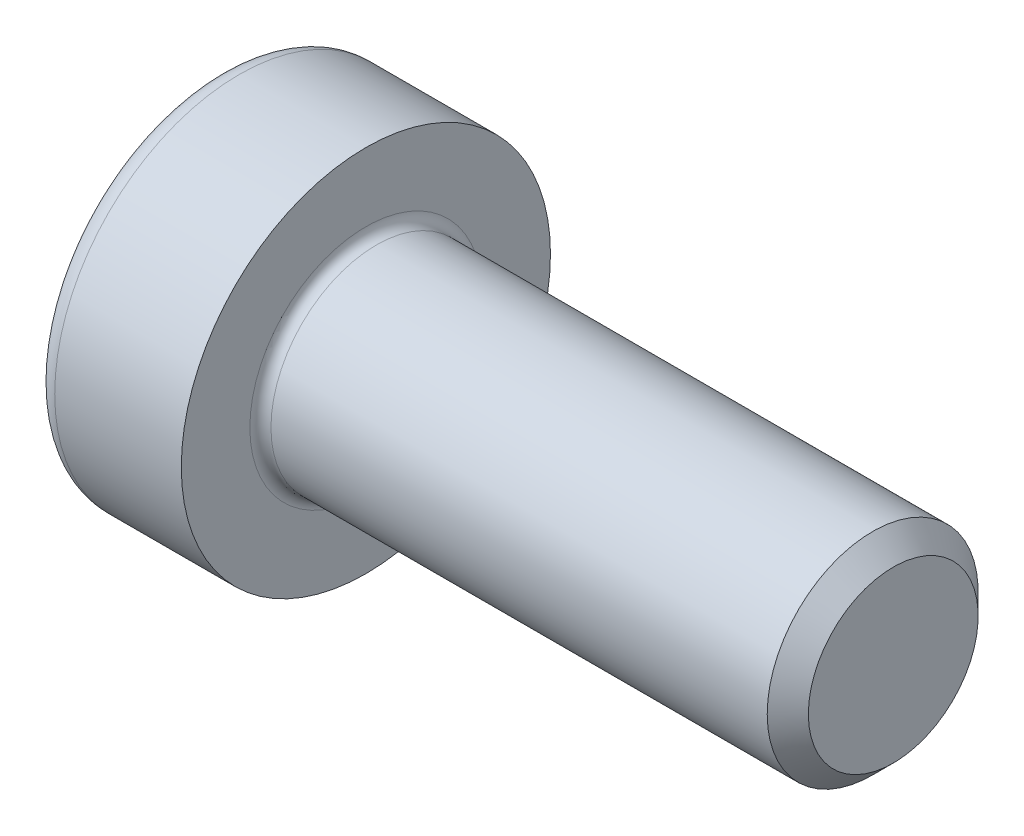
ISO-10303-21;
HEADER;
FILE_DESCRIPTION(('STEP AP214'),'2;1');
FILE_NAME('part.step','',(''),(''),'','','');
FILE_SCHEMA(('AUTOMOTIVE_DESIGN { 1 0 10303 214 1 1 1 1 }'));
ENDSEC;
DATA;
#1=APPLICATION_CONTEXT('core data for automotive mechanical design processes');
#2=APPLICATION_PROTOCOL_DEFINITION('international standard','automotive_design',2000,#1);
#3=PRODUCT_CONTEXT('',#1,'mechanical');
#4=PRODUCT('Part','Part','',(#3));
#5=PRODUCT_RELATED_PRODUCT_CATEGORY('part','',(#4));
#6=PRODUCT_DEFINITION_FORMATION('','',#4);
#7=PRODUCT_DEFINITION_CONTEXT('part definition',#1,'design');
#8=PRODUCT_DEFINITION('design','',#6,#7);
#9=PRODUCT_DEFINITION_SHAPE('','',#8);
#10=(LENGTH_UNIT() NAMED_UNIT(*) SI_UNIT(.MILLI.,.METRE.));
#11=(NAMED_UNIT(*) PLANE_ANGLE_UNIT() SI_UNIT($,.RADIAN.));
#12=(NAMED_UNIT(*) SI_UNIT($,.STERADIAN.) SOLID_ANGLE_UNIT());
#13=UNCERTAINTY_MEASURE_WITH_UNIT(LENGTH_MEASURE(1.E-05),#10,'distance_accuracy_value','');
#14=(GEOMETRIC_REPRESENTATION_CONTEXT(3) GLOBAL_UNCERTAINTY_ASSIGNED_CONTEXT((#13)) GLOBAL_UNIT_ASSIGNED_CONTEXT((#10,
#11,#12)) REPRESENTATION_CONTEXT('',''));
#15=CARTESIAN_POINT('',(0.,0.,0.));
#16=DIRECTION('',(0.,0.,1.));
#17=DIRECTION('',(1.,0.,0.));
#18=AXIS2_PLACEMENT_3D('',#15,#16,#17);
#19=CARTESIAN_POINT('',(1.6,0.866025403784449,1.49999999999999));
#20=DIRECTION('',(-1.,0.,0.));
#21=DIRECTION('',(0.,0.,1.));
#22=AXIS2_PLACEMENT_3D('',#19,#20,#21);
#23=PLANE('',#22);
#24=CARTESIAN_POINT('',(1.6,0.,0.));
#25=DIRECTION('',(-1.,0.,0.));
#26=DIRECTION('',(0.,0.,1.));
#27=AXIS2_PLACEMENT_3D('',#24,#25,#26);
#28=CIRCLE('',#27,1.5);
#29=CARTESIAN_POINT('',(1.6,0.,1.5));
#30=VERTEX_POINT('',#29);
#31=CARTESIAN_POINT('',(1.6,1.29903810567666,0.749999999999996));
#32=VERTEX_POINT('',#31);
#33=EDGE_CURVE('E121',#30,#32,#28,.T.);
#34=ORIENTED_EDGE('',*,*,#33,.F.);
#35=DIRECTION('',(0.,1.,0.));
#36=VECTOR('',#35,1.);
#37=CARTESIAN_POINT('',(1.6,-0.866025403784428,1.5));
#38=LINE('',#37,#36);
#39=CARTESIAN_POINT('',(1.6,0.866025403784449,1.49999999999999));
#40=VERTEX_POINT('',#39);
#41=EDGE_CURVE('E128',#30,#40,#38,.T.);
#42=ORIENTED_EDGE('',*,*,#41,.T.);
#43=DIRECTION('',(0.,-0.499999999999998,0.86602540378444));
#44=VECTOR('',#43,1.);
#45=CARTESIAN_POINT('',(1.6,1.73205080756888,0.));
#46=LINE('',#45,#44);
#47=EDGE_CURVE('E129',#32,#40,#46,.T.);
#48=ORIENTED_EDGE('',*,*,#47,.F.);
#49=EDGE_LOOP('',(#34,#42,#48));
#50=FACE_BOUND('',#49,.T.);
#51=ADVANCED_FACE('F37',(#50),#23,.T.);
#52=CARTESIAN_POINT('',(1.6,0.,0.));
#53=DIRECTION('',(-1.,0.,0.));
#54=DIRECTION('',(0.,0.,1.));
#55=AXIS2_PLACEMENT_3D('',#52,#53,#54);
#56=CIRCLE('',#55,1.5);
#57=CARTESIAN_POINT('',(1.6,1.29903810567666,-0.750000000000002));
#58=VERTEX_POINT('',#57);
#59=EDGE_CURVE('E11',#32,#58,#56,.T.);
#60=ORIENTED_EDGE('',*,*,#59,.F.);
#61=CARTESIAN_POINT('',(1.6,1.73205080756888,0.));
#62=VERTEX_POINT('',#61);
#63=EDGE_CURVE('E125',#62,#32,#46,.T.);
#64=ORIENTED_EDGE('',*,*,#63,.F.);
#65=DIRECTION('',(0.,-0.500000000000001,-0.866025403784438));
#66=VECTOR('',#65,1.);
#67=CARTESIAN_POINT('',(1.6,1.73205080756888,0.));
#68=LINE('',#67,#66);
#69=EDGE_CURVE('E146',#62,#58,#68,.T.);
#70=ORIENTED_EDGE('',*,*,#69,.T.);
#71=EDGE_LOOP('',(#60,#64,#70));
#72=FACE_BOUND('',#71,.T.);
#73=ADVANCED_FACE('F250',(#72),#23,.T.);
#74=CARTESIAN_POINT('',(1.6,0.,-1.5));
#75=VERTEX_POINT('',#74);
#76=EDGE_CURVE('E46',#58,#75,#56,.T.);
#77=ORIENTED_EDGE('',*,*,#76,.F.);
#78=CARTESIAN_POINT('',(1.6,0.866025403784443,-1.50000000000001));
#79=VERTEX_POINT('',#78);
#80=EDGE_CURVE('E145',#58,#79,#68,.T.);
#81=ORIENTED_EDGE('',*,*,#80,.T.);
#82=DIRECTION('',(0.,-1.,0.));
#83=VECTOR('',#82,1.);
#84=CARTESIAN_POINT('',(1.6,0.866025403784443,-1.50000000000001));
#85=LINE('',#84,#83);
#86=EDGE_CURVE('E142',#79,#75,#85,.T.);
#87=ORIENTED_EDGE('',*,*,#86,.T.);
#88=EDGE_LOOP('',(#77,#81,#87));
#89=FACE_BOUND('',#88,.T.);
#90=ADVANCED_FACE('F215',(#89),#23,.T.);
#91=CARTESIAN_POINT('',(1.6,-1.29903810567666,-0.749999999999997));
#92=VERTEX_POINT('',#91);
#93=EDGE_CURVE('E199',#75,#92,#56,.T.);
#94=ORIENTED_EDGE('',*,*,#93,.F.);
#95=CARTESIAN_POINT('',(1.6,-0.866025403784433,-1.50000000000001));
#96=VERTEX_POINT('',#95);
#97=EDGE_CURVE('E141',#75,#96,#85,.T.);
#98=ORIENTED_EDGE('',*,*,#97,.T.);
#99=DIRECTION('',(0.,0.499999999999998,-0.86602540378444));
#100=VECTOR('',#99,1.);
#101=CARTESIAN_POINT('',(1.6,-1.73205080756887,0.));
#102=LINE('',#101,#100);
#103=EDGE_CURVE('E137',#92,#96,#102,.T.);
#104=ORIENTED_EDGE('',*,*,#103,.F.);
#105=EDGE_LOOP('',(#94,#98,#104));
#106=FACE_BOUND('',#105,.T.);
#107=ADVANCED_FACE('F210',(#106),#23,.T.);
#108=CARTESIAN_POINT('',(1.6,-1.29903810567665,0.749999999999996));
#109=VERTEX_POINT('',#108);
#110=EDGE_CURVE('E53',#92,#109,#56,.T.);
#111=ORIENTED_EDGE('',*,*,#110,.F.);
#112=CARTESIAN_POINT('',(1.6,-1.73205080756887,0.));
#113=VERTEX_POINT('',#112);
#114=EDGE_CURVE('E138',#113,#92,#102,.T.);
#115=ORIENTED_EDGE('',*,*,#114,.F.);
#116=DIRECTION('',(0.,-0.500000000000001,-0.866025403784438));
#117=VECTOR('',#116,1.);
#118=CARTESIAN_POINT('',(1.6,-0.866025403784428,1.5));
#119=LINE('',#118,#117);
#120=EDGE_CURVE('E133',#109,#113,#119,.T.);
#121=ORIENTED_EDGE('',*,*,#120,.F.);
#122=EDGE_LOOP('',(#111,#115,#121));
#123=FACE_BOUND('',#122,.T.);
#124=ADVANCED_FACE('F233',(#123),#23,.T.);
#125=CARTESIAN_POINT('',(0.,0.,0.));
#126=DIRECTION('',(-1.,0.,0.));
#127=DIRECTION('',(0.,0.,1.));
#128=AXIS2_PLACEMENT_3D('',#125,#126,#127);
#129=PLANE('',#128);
#130=CARTESIAN_POINT('',(0.,0.,0.));
#131=DIRECTION('',(-1.,0.,0.));
#132=DIRECTION('',(0.,0.,1.));
#133=AXIS2_PLACEMENT_3D('',#130,#131,#132);
#134=CIRCLE('',#133,3.1);
#135=CARTESIAN_POINT('',(0.,0.,3.1));
#136=VERTEX_POINT('',#135);
#137=EDGE_CURVE('E192',#136,#136,#134,.T.);
#138=ORIENTED_EDGE('',*,*,#137,.T.);
#139=EDGE_LOOP('',(#138));
#140=FACE_BOUND('',#139,.T.);
#141=DIRECTION('',(0.,-0.500000000000001,-0.866025403784438));
#142=VECTOR('',#141,1.);
#143=CARTESIAN_POINT('',(0.,1.73205080756888,0.));
#144=LINE('',#143,#142);
#145=CARTESIAN_POINT('',(0.,1.73205080756888,0.));
#146=VERTEX_POINT('',#145);
#147=CARTESIAN_POINT('',(0.,0.866025403784443,-1.50000000000001));
#148=VERTEX_POINT('',#147);
#149=EDGE_CURVE('E161',#146,#148,#144,.T.);
#150=ORIENTED_EDGE('',*,*,#149,.F.);
#151=DIRECTION('',(0.,-0.499999999999998,0.86602540378444));
#152=VECTOR('',#151,1.);
#153=CARTESIAN_POINT('',(0.,1.73205080756888,0.));
#154=LINE('',#153,#152);
#155=CARTESIAN_POINT('',(0.,0.866025403784449,1.49999999999999));
#156=VERTEX_POINT('',#155);
#157=EDGE_CURVE('E61',#146,#156,#154,.T.);
#158=ORIENTED_EDGE('',*,*,#157,.T.);
#159=DIRECTION('',(0.,1.,0.));
#160=VECTOR('',#159,1.);
#161=CARTESIAN_POINT('',(0.,-0.866025403784428,1.5));
#162=LINE('',#161,#160);
#163=CARTESIAN_POINT('',(0.,-0.866025403784428,1.5));
#164=VERTEX_POINT('',#163);
#165=EDGE_CURVE('E151',#164,#156,#162,.T.);
#166=ORIENTED_EDGE('',*,*,#165,.F.);
#167=DIRECTION('',(0.,-0.500000000000001,-0.866025403784438));
#168=VECTOR('',#167,1.);
#169=CARTESIAN_POINT('',(0.,-0.866025403784428,1.5));
#170=LINE('',#169,#168);
#171=CARTESIAN_POINT('',(0.,-1.73205080756887,0.));
#172=VERTEX_POINT('',#171);
#173=EDGE_CURVE('E154',#164,#172,#170,.T.);
#174=ORIENTED_EDGE('',*,*,#173,.T.);
#175=DIRECTION('',(0.,0.499999999999998,-0.86602540378444));
#176=VECTOR('',#175,1.);
#177=CARTESIAN_POINT('',(0.,-1.73205080756887,0.));
#178=LINE('',#177,#176);
#179=CARTESIAN_POINT('',(0.,-0.866025403784433,-1.50000000000001));
#180=VERTEX_POINT('',#179);
#181=EDGE_CURVE('E156',#172,#180,#178,.T.);
#182=ORIENTED_EDGE('',*,*,#181,.T.);
#183=DIRECTION('',(0.,-1.,0.));
#184=VECTOR('',#183,1.);
#185=CARTESIAN_POINT('',(0.,0.866025403784443,-1.50000000000001));
#186=LINE('',#185,#184);
#187=EDGE_CURVE('E158',#148,#180,#186,.T.);
#188=ORIENTED_EDGE('',*,*,#187,.F.);
#189=EDGE_LOOP('',(#150,#158,#166,#174,#182,#188));
#190=FACE_BOUND('',#189,.T.);
#191=ADVANCED_FACE('F223',(#140,#190),#129,.T.);
#192=CARTESIAN_POINT('',(-31.75,0.,0.));
#193=DIRECTION('',(-1.,0.,0.));
#194=DIRECTION('',(0.,0.,1.));
#195=AXIS2_PLACEMENT_3D('',#192,#193,#194);
#196=CYLINDRICAL_SURFACE('',#195,3.5);
#197=CARTESIAN_POINT('',(0.399999999999998,0.,0.));
#198=DIRECTION('',(-1.,0.,0.));
#199=DIRECTION('',(0.,0.,1.));
#200=AXIS2_PLACEMENT_3D('',#197,#198,#199);
#201=CIRCLE('',#200,3.5);
#202=CARTESIAN_POINT('',(0.399999999999998,0.,3.5));
#203=VERTEX_POINT('',#202);
#204=EDGE_CURVE('E194',#203,#203,#201,.F.);
#205=ORIENTED_EDGE('',*,*,#204,.T.);
#206=EDGE_LOOP('',(#205));
#207=FACE_BOUND('',#206,.T.);
#208=CARTESIAN_POINT('',(2.8,0.,0.));
#209=DIRECTION('',(-1.,0.,0.));
#210=DIRECTION('',(0.,0.,1.));
#211=AXIS2_PLACEMENT_3D('',#208,#209,#210);
#212=CIRCLE('',#211,3.5);
#213=CARTESIAN_POINT('',(2.8,0.,3.5));
#214=VERTEX_POINT('',#213);
#215=EDGE_CURVE('E183',#214,#214,#212,.T.);
#216=ORIENTED_EDGE('',*,*,#215,.T.);
#217=EDGE_LOOP('',(#216));
#218=FACE_BOUND('',#217,.T.);
#219=ADVANCED_FACE('F289',(#207,#218),#196,.T.);
#220=CARTESIAN_POINT('',(2.8,3.5,0.));
#221=DIRECTION('',(1.,0.,0.));
#222=DIRECTION('',(0.,0.,-1.));
#223=AXIS2_PLACEMENT_3D('',#220,#221,#222);
#224=PLANE('',#223);
#225=CARTESIAN_POINT('',(2.8,0.,0.));
#226=DIRECTION('',(1.,0.,0.));
#227=DIRECTION('',(0.,0.,-1.));
#228=AXIS2_PLACEMENT_3D('',#225,#226,#227);
#229=CIRCLE('',#228,2.2);
#230=CARTESIAN_POINT('',(2.8,0.,-2.2));
#231=VERTEX_POINT('',#230);
#232=EDGE_CURVE('E186',#231,#231,#229,.F.);
#233=ORIENTED_EDGE('',*,*,#232,.T.);
#234=EDGE_LOOP('',(#233));
#235=FACE_BOUND('',#234,.T.);
#236=ORIENTED_EDGE('',*,*,#215,.F.);
#237=EDGE_LOOP('',(#236));
#238=FACE_BOUND('',#237,.T.);
#239=ADVANCED_FACE('F285',(#235,#238),#224,.T.);
#240=CARTESIAN_POINT('',(-31.75,0.,0.));
#241=DIRECTION('',(-1.,0.,0.));
#242=DIRECTION('',(0.,0.,1.));
#243=AXIS2_PLACEMENT_3D('',#240,#241,#242);
#244=CYLINDRICAL_SURFACE('',#243,2.);
#245=CARTESIAN_POINT('',(3.,0.,0.));
#246=DIRECTION('',(1.,0.,0.));
#247=DIRECTION('',(0.,0.,-1.));
#248=AXIS2_PLACEMENT_3D('',#245,#246,#247);
#249=CIRCLE('',#248,2.);
#250=CARTESIAN_POINT('',(3.,0.,-2.));
#251=VERTEX_POINT('',#250);
#252=EDGE_CURVE('E189',#251,#251,#249,.T.);
#253=ORIENTED_EDGE('',*,*,#252,.T.);
#254=EDGE_LOOP('',(#253));
#255=FACE_BOUND('',#254,.T.);
#256=CARTESIAN_POINT('',(12.41,0.,0.));
#257=DIRECTION('',(-1.,0.,0.));
#258=DIRECTION('',(0.,0.,1.));
#259=AXIS2_PLACEMENT_3D('',#256,#257,#258);
#260=CIRCLE('',#259,2.);
#261=CARTESIAN_POINT('',(12.41,0.,2.));
#262=VERTEX_POINT('',#261);
#263=EDGE_CURVE('E180',#262,#262,#260,.T.);
#264=ORIENTED_EDGE('',*,*,#263,.T.);
#265=EDGE_LOOP('',(#264));
#266=FACE_BOUND('',#265,.T.);
#267=ADVANCED_FACE('F281',(#255,#266),#244,.T.);
#268=CARTESIAN_POINT('',(12.8,0.,0.));
#269=DIRECTION('',(-1.,0.,0.));
#270=DIRECTION('',(0.,0.,1.));
#271=AXIS2_PLACEMENT_3D('',#268,#269,#270);
#272=CONICAL_SURFACE('',#271,1.61,0.785398163397464);
#273=ORIENTED_EDGE('',*,*,#263,.F.);
#274=EDGE_LOOP('',(#273));
#275=FACE_BOUND('',#274,.T.);
#276=CARTESIAN_POINT('',(12.8,0.,0.));
#277=DIRECTION('',(-1.,0.,0.));
#278=DIRECTION('',(0.,0.,1.));
#279=AXIS2_PLACEMENT_3D('',#276,#277,#278);
#280=CIRCLE('',#279,1.61);
#281=CARTESIAN_POINT('',(12.8,0.,1.61));
#282=VERTEX_POINT('',#281);
#283=EDGE_CURVE('E177',#282,#282,#280,.T.);
#284=ORIENTED_EDGE('',*,*,#283,.T.);
#285=EDGE_LOOP('',(#284));
#286=FACE_BOUND('',#285,.T.);
#287=ADVANCED_FACE('F277',(#275,#286),#272,.T.);
#288=CARTESIAN_POINT('',(12.8,1.61,0.));
#289=DIRECTION('',(1.,0.,0.));
#290=DIRECTION('',(0.,0.,-1.));
#291=AXIS2_PLACEMENT_3D('',#288,#289,#290);
#292=PLANE('',#291);
#293=ORIENTED_EDGE('',*,*,#283,.F.);
#294=EDGE_LOOP('',(#293));
#295=FACE_BOUND('',#294,.T.);
#296=ADVANCED_FACE('F273',(#295),#292,.T.);
#297=CARTESIAN_POINT('',(3.,0.,0.));
#298=DIRECTION('',(1.,0.,0.));
#299=DIRECTION('',(0.,0.,-1.));
#300=AXIS2_PLACEMENT_3D('',#297,#298,#299);
#301=TOROIDAL_SURFACE('',#300,2.2,0.2);
#302=ORIENTED_EDGE('',*,*,#252,.F.);
#303=EDGE_LOOP('',(#302));
#304=FACE_BOUND('',#303,.T.);
#305=ORIENTED_EDGE('',*,*,#232,.F.);
#306=EDGE_LOOP('',(#305));
#307=FACE_BOUND('',#306,.T.);
#308=ADVANCED_FACE('F276',(#304,#307),#301,.F.);
#309=CARTESIAN_POINT('',(0.399999999999998,0.,0.));
#310=DIRECTION('',(-1.,0.,0.));
#311=DIRECTION('',(0.,0.,1.));
#312=AXIS2_PLACEMENT_3D('',#309,#310,#311);
#313=TOROIDAL_SURFACE('',#312,3.1,0.4);
#314=ORIENTED_EDGE('',*,*,#204,.F.);
#315=EDGE_LOOP('',(#314));
#316=FACE_BOUND('',#315,.T.);
#317=ORIENTED_EDGE('',*,*,#137,.F.);
#318=EDGE_LOOP('',(#317));
#319=FACE_BOUND('',#318,.T.);
#320=ADVANCED_FACE('F39',(#316,#319),#313,.T.);
#321=CARTESIAN_POINT('',(1.6,1.73205080756888,0.));
#322=DIRECTION('',(0.,-0.86602540378444,-0.499999999999998));
#323=DIRECTION('',(0.,0.499999999999998,-0.86602540378444));
#324=AXIS2_PLACEMENT_3D('',#321,#322,#323);
#325=PLANE('',#324);
#326=DIRECTION('',(-1.,0.,0.));
#327=VECTOR('',#326,1.);
#328=CARTESIAN_POINT('',(1.6,0.866025403784449,1.49999999999999));
#329=LINE('',#328,#327);
#330=EDGE_CURVE('E175',#40,#156,#329,.T.);
#331=ORIENTED_EDGE('',*,*,#330,.T.);
#332=ORIENTED_EDGE('',*,*,#157,.F.);
#333=DIRECTION('',(-1.,0.,0.));
#334=VECTOR('',#333,1.);
#335=CARTESIAN_POINT('',(1.6,1.73205080756888,0.));
#336=LINE('',#335,#334);
#337=EDGE_CURVE('E149',#62,#146,#336,.T.);
#338=ORIENTED_EDGE('',*,*,#337,.F.);
#339=ORIENTED_EDGE('',*,*,#63,.T.);
#340=ORIENTED_EDGE('',*,*,#47,.T.);
#341=EDGE_LOOP('',(#331,#332,#338,#339,#340));
#342=FACE_BOUND('',#341,.T.);
#343=ADVANCED_FACE('F247',(#342),#325,.T.);
#344=CARTESIAN_POINT('',(1.6,-0.866025403784428,1.5));
#345=DIRECTION('',(0.,0.,1.));
#346=DIRECTION('',(0.,-1.,0.));
#347=AXIS2_PLACEMENT_3D('',#344,#345,#346);
#348=PLANE('',#347);
#349=ORIENTED_EDGE('',*,*,#41,.F.);
#350=CARTESIAN_POINT('',(1.6,-0.866025403784428,1.5));
#351=VERTEX_POINT('',#350);
#352=EDGE_CURVE('E130',#351,#30,#38,.T.);
#353=ORIENTED_EDGE('',*,*,#352,.F.);
#354=DIRECTION('',(-1.,0.,0.));
#355=VECTOR('',#354,1.);
#356=CARTESIAN_POINT('',(1.6,-0.866025403784428,1.5));
#357=LINE('',#356,#355);
#358=EDGE_CURVE('E173',#351,#164,#357,.T.);
#359=ORIENTED_EDGE('',*,*,#358,.T.);
#360=ORIENTED_EDGE('',*,*,#165,.T.);
#361=ORIENTED_EDGE('',*,*,#330,.F.);
#362=EDGE_LOOP('',(#349,#353,#359,#360,#361));
#363=FACE_BOUND('',#362,.T.);
#364=ADVANCED_FACE('F242',(#363),#348,.F.);
#365=CARTESIAN_POINT('',(1.6,-0.866025403784428,1.5));
#366=DIRECTION('',(0.,0.866025403784438,-0.500000000000001));
#367=DIRECTION('',(0.,0.500000000000001,0.866025403784438));
#368=AXIS2_PLACEMENT_3D('',#365,#366,#367);
#369=PLANE('',#368);
#370=DIRECTION('',(-1.,0.,0.));
#371=VECTOR('',#370,1.);
#372=CARTESIAN_POINT('',(1.6,-1.73205080756887,0.));
#373=LINE('',#372,#371);
#374=EDGE_CURVE('E170',#113,#172,#373,.T.);
#375=ORIENTED_EDGE('',*,*,#374,.T.);
#376=ORIENTED_EDGE('',*,*,#173,.F.);
#377=ORIENTED_EDGE('',*,*,#358,.F.);
#378=EDGE_CURVE('E134',#351,#109,#119,.T.);
#379=ORIENTED_EDGE('',*,*,#378,.T.);
#380=ORIENTED_EDGE('',*,*,#120,.T.);
#381=EDGE_LOOP('',(#375,#376,#377,#379,#380));
#382=FACE_BOUND('',#381,.T.);
#383=ADVANCED_FACE('F236',(#382),#369,.T.);
#384=CARTESIAN_POINT('',(1.6,-1.73205080756887,0.));
#385=DIRECTION('',(0.,0.86602540378444,0.499999999999998));
#386=DIRECTION('',(0.,-0.499999999999998,0.86602540378444));
#387=AXIS2_PLACEMENT_3D('',#384,#385,#386);
#388=PLANE('',#387);
#389=DIRECTION('',(-1.,0.,0.));
#390=VECTOR('',#389,1.);
#391=CARTESIAN_POINT('',(1.6,-0.866025403784433,-1.50000000000001));
#392=LINE('',#391,#390);
#393=EDGE_CURVE('E167',#96,#180,#392,.T.);
#394=ORIENTED_EDGE('',*,*,#393,.T.);
#395=ORIENTED_EDGE('',*,*,#181,.F.);
#396=ORIENTED_EDGE('',*,*,#374,.F.);
#397=ORIENTED_EDGE('',*,*,#114,.T.);
#398=ORIENTED_EDGE('',*,*,#103,.T.);
#399=EDGE_LOOP('',(#394,#395,#396,#397,#398));
#400=FACE_BOUND('',#399,.T.);
#401=ADVANCED_FACE('F229',(#400),#388,.T.);
#402=CARTESIAN_POINT('',(1.6,0.866025403784443,-1.50000000000001));
#403=DIRECTION('',(0.,0.,-1.));
#404=DIRECTION('',(0.,1.,0.));
#405=AXIS2_PLACEMENT_3D('',#402,#403,#404);
#406=PLANE('',#405);
#407=ORIENTED_EDGE('',*,*,#97,.F.);
#408=ORIENTED_EDGE('',*,*,#86,.F.);
#409=DIRECTION('',(-1.,0.,0.));
#410=VECTOR('',#409,1.);
#411=CARTESIAN_POINT('',(1.6,0.866025403784443,-1.50000000000001));
#412=LINE('',#411,#410);
#413=EDGE_CURVE('E164',#79,#148,#412,.T.);
#414=ORIENTED_EDGE('',*,*,#413,.T.);
#415=ORIENTED_EDGE('',*,*,#187,.T.);
#416=ORIENTED_EDGE('',*,*,#393,.F.);
#417=EDGE_LOOP('',(#407,#408,#414,#415,#416));
#418=FACE_BOUND('',#417,.T.);
#419=ADVANCED_FACE('F214',(#418),#406,.F.);
#420=CARTESIAN_POINT('',(1.6,1.73205080756888,0.));
#421=DIRECTION('',(0.,0.866025403784438,-0.500000000000001));
#422=DIRECTION('',(0.,0.500000000000001,0.866025403784438));
#423=AXIS2_PLACEMENT_3D('',#420,#421,#422);
#424=PLANE('',#423);
#425=ORIENTED_EDGE('',*,*,#80,.F.);
#426=ORIENTED_EDGE('',*,*,#69,.F.);
#427=ORIENTED_EDGE('',*,*,#337,.T.);
#428=ORIENTED_EDGE('',*,*,#149,.T.);
#429=ORIENTED_EDGE('',*,*,#413,.F.);
#430=EDGE_LOOP('',(#425,#426,#427,#428,#429));
#431=FACE_BOUND('',#430,.T.);
#432=ADVANCED_FACE('F219',(#431),#424,.F.);
#433=EDGE_CURVE('E41',#109,#30,#56,.T.);
#434=ORIENTED_EDGE('',*,*,#433,.F.);
#435=ORIENTED_EDGE('',*,*,#378,.F.);
#436=ORIENTED_EDGE('',*,*,#352,.T.);
#437=EDGE_LOOP('',(#434,#435,#436));
#438=FACE_BOUND('',#437,.T.);
#439=ADVANCED_FACE('F239',(#438),#23,.T.);
#440=CARTESIAN_POINT('',(1.6,0.,0.));
#441=DIRECTION('',(-1.,0.,0.));
#442=DIRECTION('',(0.,0.,1.));
#443=AXIS2_PLACEMENT_3D('',#440,#441,#442);
#444=CONICAL_SURFACE('',#443,1.5,1.04719755119659);
#445=CARTESIAN_POINT('',(1.88867513459482,0.,0.));
#446=DIRECTION('',(-1.,0.,0.));
#447=DIRECTION('',(0.,0.,1.));
#448=AXIS2_PLACEMENT_3D('',#445,#446,#447);
#449=CIRCLE('',#448,1.);
#450=CARTESIAN_POINT('',(1.88867513459482,0.,1.));
#451=VERTEX_POINT('',#450);
#452=EDGE_CURVE('E118',#451,#451,#449,.T.);
#453=ORIENTED_EDGE('',*,*,#452,.F.);
#454=EDGE_LOOP('',(#453));
#455=FACE_BOUND('',#454,.T.);
#456=ORIENTED_EDGE('',*,*,#33,.T.);
#457=ORIENTED_EDGE('',*,*,#59,.T.);
#458=ORIENTED_EDGE('',*,*,#76,.T.);
#459=ORIENTED_EDGE('',*,*,#93,.T.);
#460=ORIENTED_EDGE('',*,*,#110,.T.);
#461=ORIENTED_EDGE('',*,*,#433,.T.);
#462=EDGE_LOOP('',(#456,#457,#458,#459,#460,#461));
#463=FACE_BOUND('',#462,.T.);
#464=ADVANCED_FACE('F202',(#455,#463),#444,.F.);
#465=CARTESIAN_POINT('',(0.,0.,0.));
#466=DIRECTION('',(-1.,0.,0.));
#467=DIRECTION('',(0.,0.,1.));
#468=AXIS2_PLACEMENT_3D('',#465,#466,#467);
#469=CYLINDRICAL_SURFACE('',#468,1.);
#470=CARTESIAN_POINT('',(3.3,0.,0.));
#471=DIRECTION('',(-1.,0.,0.));
#472=DIRECTION('',(0.,0.,1.));
#473=AXIS2_PLACEMENT_3D('',#470,#471,#472);
#474=CIRCLE('',#473,1.);
#475=CARTESIAN_POINT('',(3.3,0.,1.));
#476=VERTEX_POINT('',#475);
#477=EDGE_CURVE('E116',#476,#476,#474,.T.);
#478=ORIENTED_EDGE('',*,*,#477,.F.);
#479=EDGE_LOOP('',(#478));
#480=FACE_BOUND('',#479,.T.);
#481=ORIENTED_EDGE('',*,*,#452,.T.);
#482=EDGE_LOOP('',(#481));
#483=FACE_BOUND('',#482,.T.);
#484=ADVANCED_FACE('F112',(#480,#483),#469,.F.);
#485=CARTESIAN_POINT('',(3.3,0.,0.));
#486=DIRECTION('',(-1.,0.,0.));
#487=DIRECTION('',(0.,0.,1.));
#488=AXIS2_PLACEMENT_3D('',#485,#486,#487);
#489=CONICAL_SURFACE('',#488,1.,1.04719755119659);
#490=CARTESIAN_POINT('',(3.87735026918963,0.,0.));
#491=VERTEX_POINT('',#490);
#492=VERTEX_LOOP('',#491);
#493=FACE_BOUND('',#492,.T.);
#494=ORIENTED_EDGE('',*,*,#477,.T.);
#495=EDGE_LOOP('',(#494));
#496=FACE_BOUND('',#495,.T.);
#497=ADVANCED_FACE('F109',(#493,#496),#489,.F.);
#498=CLOSED_SHELL('',(#51,#73,#90,#107,#124,#191,#219,#239,#267,#287,#296,#308,#320,#343,#364,
#383,#401,#419,#432,#439,#464,#484,#497));
#499=MANIFOLD_SOLID_BREP('B2',#498);
#500=ADVANCED_BREP_SHAPE_REPRESENTATION('',(#18,#499),#14);
#501=SHAPE_DEFINITION_REPRESENTATION(#9,#500);
ENDSEC;
END-ISO-10303-21;
